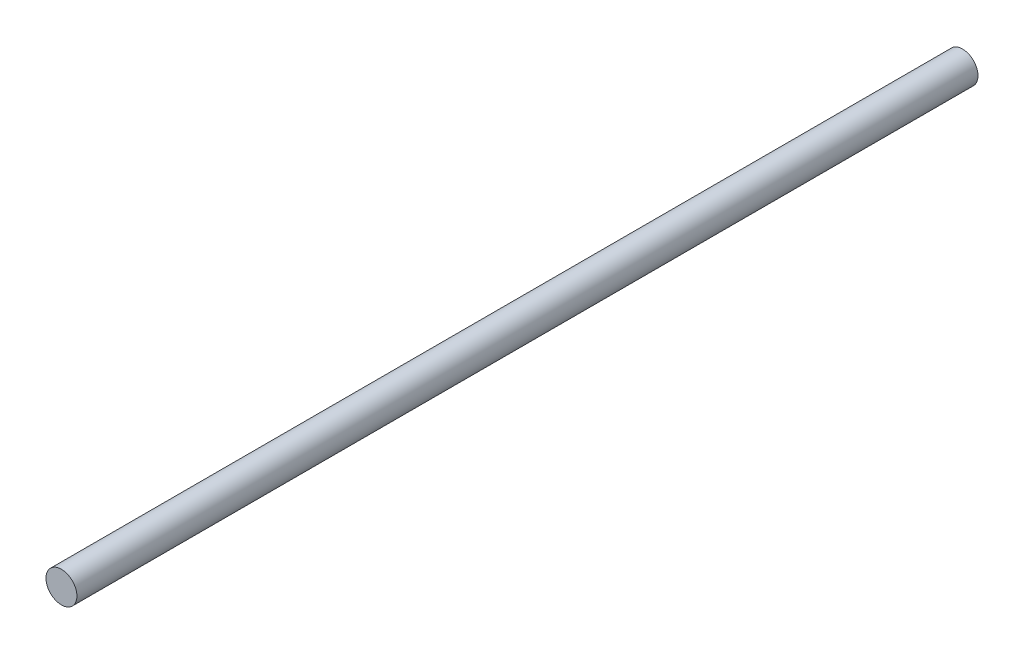
ISO-10303-21;
HEADER;
FILE_DESCRIPTION(('STEP AP214'),'2;1');
FILE_NAME('part.step','',(''),(''),'','','');
FILE_SCHEMA(('AUTOMOTIVE_DESIGN { 1 0 10303 214 1 1 1 1 }'));
ENDSEC;
DATA;
#1=APPLICATION_CONTEXT('core data for automotive mechanical design processes');
#2=APPLICATION_PROTOCOL_DEFINITION('international standard','automotive_design',2000,#1);
#3=PRODUCT_CONTEXT('',#1,'mechanical');
#4=PRODUCT('Part','Part','',(#3));
#5=PRODUCT_RELATED_PRODUCT_CATEGORY('part','',(#4));
#6=PRODUCT_DEFINITION_FORMATION('','',#4);
#7=PRODUCT_DEFINITION_CONTEXT('part definition',#1,'design');
#8=PRODUCT_DEFINITION('design','',#6,#7);
#9=PRODUCT_DEFINITION_SHAPE('','',#8);
#10=(LENGTH_UNIT() NAMED_UNIT(*) SI_UNIT(.MILLI.,.METRE.));
#11=(NAMED_UNIT(*) PLANE_ANGLE_UNIT() SI_UNIT($,.RADIAN.));
#12=(NAMED_UNIT(*) SI_UNIT($,.STERADIAN.) SOLID_ANGLE_UNIT());
#13=UNCERTAINTY_MEASURE_WITH_UNIT(LENGTH_MEASURE(1.E-05),#10,'distance_accuracy_value','');
#14=(GEOMETRIC_REPRESENTATION_CONTEXT(3) GLOBAL_UNCERTAINTY_ASSIGNED_CONTEXT((#13)) GLOBAL_UNIT_ASSIGNED_CONTEXT((#10,
#11,#12)) REPRESENTATION_CONTEXT('',''));
#15=CARTESIAN_POINT('',(0.,0.,0.));
#16=DIRECTION('',(0.,0.,1.));
#17=DIRECTION('',(1.,0.,0.));
#18=AXIS2_PLACEMENT_3D('',#15,#16,#17);
#19=CARTESIAN_POINT('',(0.,0.,204.));
#20=DIRECTION('',(0.,0.,-1.));
#21=DIRECTION('',(-1.,0.,0.));
#22=AXIS2_PLACEMENT_3D('',#19,#20,#21);
#23=CYLINDRICAL_SURFACE('',#22,3.5);
#24=CARTESIAN_POINT('',(0.,0.,204.));
#25=DIRECTION('',(0.,0.,1.));
#26=DIRECTION('',(1.,0.,0.));
#27=AXIS2_PLACEMENT_3D('',#24,#25,#26);
#28=CIRCLE('',#27,3.5);
#29=CARTESIAN_POINT('',(3.5,0.,204.));
#30=VERTEX_POINT('',#29);
#31=EDGE_CURVE('E10',#30,#30,#28,.T.);
#32=ORIENTED_EDGE('',*,*,#31,.F.);
#33=EDGE_LOOP('',(#32));
#34=FACE_BOUND('',#33,.T.);
#35=CARTESIAN_POINT('',(0.,0.,0.));
#36=DIRECTION('',(0.,0.,1.));
#37=DIRECTION('',(1.,0.,0.));
#38=AXIS2_PLACEMENT_3D('',#35,#36,#37);
#39=CIRCLE('',#38,3.5);
#40=CARTESIAN_POINT('',(3.5,0.,0.));
#41=VERTEX_POINT('',#40);
#42=EDGE_CURVE('E36',#41,#41,#39,.T.);
#43=ORIENTED_EDGE('',*,*,#42,.T.);
#44=EDGE_LOOP('',(#43));
#45=FACE_BOUND('',#44,.T.);
#46=ADVANCED_FACE('F33',(#34,#45),#23,.T.);
#47=CARTESIAN_POINT('',(0.,0.,204.));
#48=DIRECTION('',(0.,0.,1.));
#49=DIRECTION('',(1.,0.,0.));
#50=AXIS2_PLACEMENT_3D('',#47,#48,#49);
#51=PLANE('',#50);
#52=ORIENTED_EDGE('',*,*,#31,.T.);
#53=EDGE_LOOP('',(#52));
#54=FACE_BOUND('',#53,.T.);
#55=ADVANCED_FACE('F48',(#54),#51,.T.);
#56=CARTESIAN_POINT('',(0.,0.,0.));
#57=DIRECTION('',(0.,0.,1.));
#58=DIRECTION('',(1.,0.,0.));
#59=AXIS2_PLACEMENT_3D('',#56,#57,#58);
#60=PLANE('',#59);
#61=ORIENTED_EDGE('',*,*,#42,.F.);
#62=EDGE_LOOP('',(#61));
#63=FACE_BOUND('',#62,.T.);
#64=ADVANCED_FACE('F46',(#63),#60,.F.);
#65=CLOSED_SHELL('',(#46,#55,#64));
#66=MANIFOLD_SOLID_BREP('B2',#65);
#67=ADVANCED_BREP_SHAPE_REPRESENTATION('',(#18,#66),#14);
#68=SHAPE_DEFINITION_REPRESENTATION(#9,#67);
ENDSEC;
END-ISO-10303-21;
